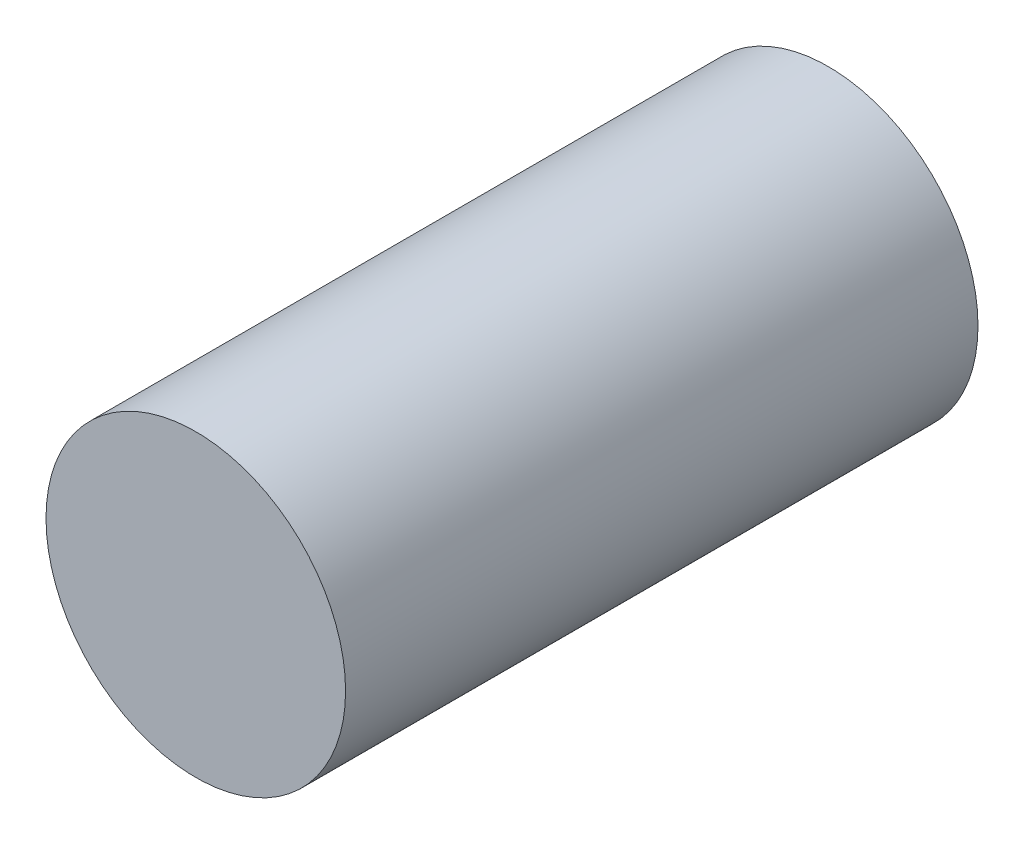
ISO-10303-21;
HEADER;
FILE_DESCRIPTION(('STEP AP214'),'2;1');
FILE_NAME('part.step','',(''),(''),'','','');
FILE_SCHEMA(('AUTOMOTIVE_DESIGN { 1 0 10303 214 1 1 1 1 }'));
ENDSEC;
DATA;
#1=APPLICATION_CONTEXT('core data for automotive mechanical design processes');
#2=APPLICATION_PROTOCOL_DEFINITION('international standard','automotive_design',2000,#1);
#3=PRODUCT_CONTEXT('',#1,'mechanical');
#4=PRODUCT('Part','Part','',(#3));
#5=PRODUCT_RELATED_PRODUCT_CATEGORY('part','',(#4));
#6=PRODUCT_DEFINITION_FORMATION('','',#4);
#7=PRODUCT_DEFINITION_CONTEXT('part definition',#1,'design');
#8=PRODUCT_DEFINITION('design','',#6,#7);
#9=PRODUCT_DEFINITION_SHAPE('','',#8);
#10=(LENGTH_UNIT() NAMED_UNIT(*) SI_UNIT(.MILLI.,.METRE.));
#11=(NAMED_UNIT(*) PLANE_ANGLE_UNIT() SI_UNIT($,.RADIAN.));
#12=(NAMED_UNIT(*) SI_UNIT($,.STERADIAN.) SOLID_ANGLE_UNIT());
#13=UNCERTAINTY_MEASURE_WITH_UNIT(LENGTH_MEASURE(1.E-05),#10,'distance_accuracy_value','');
#14=(GEOMETRIC_REPRESENTATION_CONTEXT(3) GLOBAL_UNCERTAINTY_ASSIGNED_CONTEXT((#13)) GLOBAL_UNIT_ASSIGNED_CONTEXT((#10,
#11,#12)) REPRESENTATION_CONTEXT('',''));
#15=CARTESIAN_POINT('',(0.,0.,0.));
#16=DIRECTION('',(0.,0.,1.));
#17=DIRECTION('',(1.,0.,0.));
#18=AXIS2_PLACEMENT_3D('',#15,#16,#17);
#19=CARTESIAN_POINT('',(0.,0.,-76.));
#20=DIRECTION('',(0.,0.,1.));
#21=DIRECTION('',(1.,0.,0.));
#22=AXIS2_PLACEMENT_3D('',#19,#20,#21);
#23=CYLINDRICAL_SURFACE('',#22,18.);
#24=CARTESIAN_POINT('',(0.,0.,-76.));
#25=DIRECTION('',(0.,0.,1.));
#26=DIRECTION('',(1.,0.,0.));
#27=AXIS2_PLACEMENT_3D('',#24,#25,#26);
#28=CIRCLE('',#27,18.);
#29=CARTESIAN_POINT('',(18.,0.,-76.));
#30=VERTEX_POINT('',#29);
#31=EDGE_CURVE('E10',#30,#30,#28,.T.);
#32=ORIENTED_EDGE('',*,*,#31,.T.);
#33=EDGE_LOOP('',(#32));
#34=FACE_BOUND('',#33,.T.);
#35=CARTESIAN_POINT('',(0.,0.,0.));
#36=DIRECTION('',(0.,0.,1.));
#37=DIRECTION('',(1.,0.,0.));
#38=AXIS2_PLACEMENT_3D('',#35,#36,#37);
#39=CIRCLE('',#38,18.);
#40=CARTESIAN_POINT('',(18.,0.,0.));
#41=VERTEX_POINT('',#40);
#42=EDGE_CURVE('E44',#41,#41,#39,.T.);
#43=ORIENTED_EDGE('',*,*,#42,.F.);
#44=EDGE_LOOP('',(#43));
#45=FACE_BOUND('',#44,.T.);
#46=ADVANCED_FACE('F41',(#34,#45),#23,.T.);
#47=CARTESIAN_POINT('',(0.,0.,-76.));
#48=DIRECTION('',(0.,0.,1.));
#49=DIRECTION('',(1.,0.,0.));
#50=AXIS2_PLACEMENT_3D('',#47,#48,#49);
#51=PLANE('',#50);
#52=ORIENTED_EDGE('',*,*,#31,.F.);
#53=EDGE_LOOP('',(#52));
#54=FACE_BOUND('',#53,.T.);
#55=ADVANCED_FACE('F56',(#54),#51,.F.);
#56=CARTESIAN_POINT('',(0.,0.,0.));
#57=DIRECTION('',(0.,0.,1.));
#58=DIRECTION('',(1.,0.,0.));
#59=AXIS2_PLACEMENT_3D('',#56,#57,#58);
#60=PLANE('',#59);
#61=ORIENTED_EDGE('',*,*,#42,.T.);
#62=EDGE_LOOP('',(#61));
#63=FACE_BOUND('',#62,.T.);
#64=ADVANCED_FACE('F53',(#63),#60,.T.);
#65=CLOSED_SHELL('',(#46,#55,#64));
#66=MANIFOLD_SOLID_BREP('B2',#65);
#67=ADVANCED_BREP_SHAPE_REPRESENTATION('',(#18,#66),#14);
#68=SHAPE_DEFINITION_REPRESENTATION(#9,#67);
ENDSEC;
END-ISO-10303-21;
